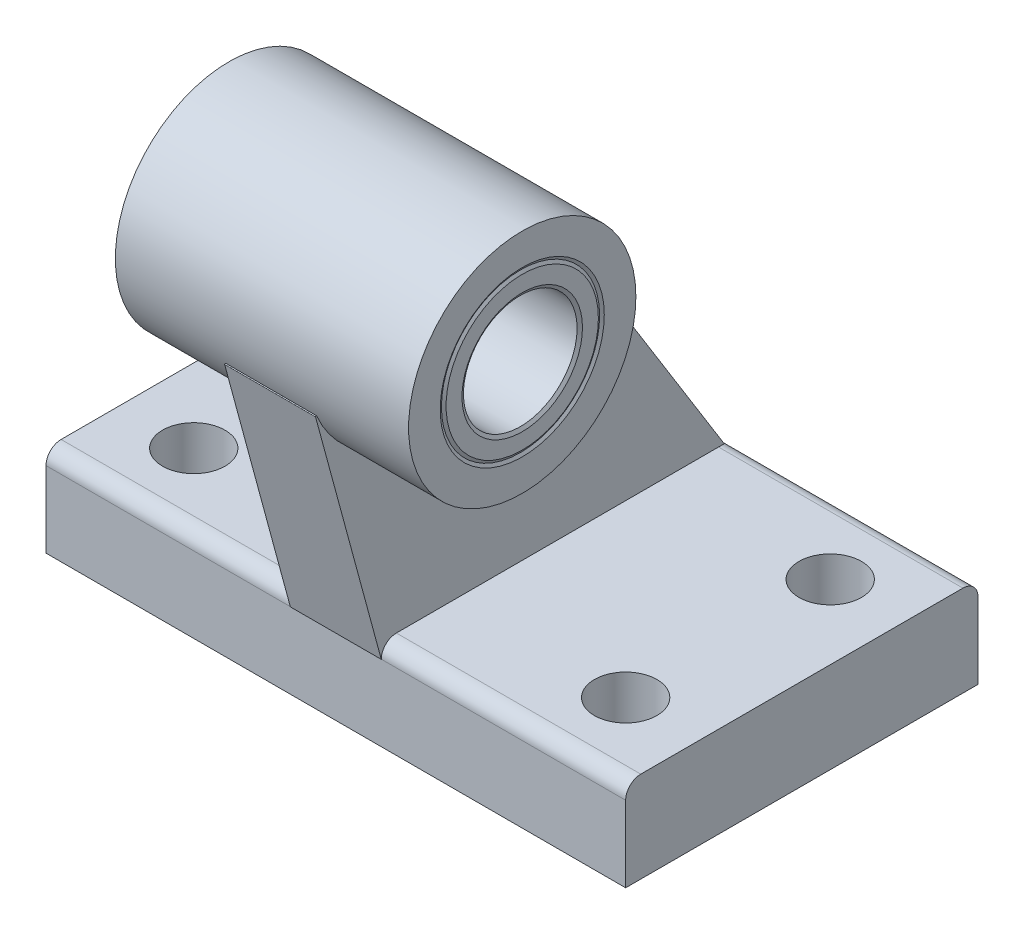
ISO-10303-21;
HEADER;
FILE_DESCRIPTION(('STEP AP214'),'2;1');
FILE_NAME('part.step','',(''),(''),'','','');
FILE_SCHEMA(('AUTOMOTIVE_DESIGN { 1 0 10303 214 1 1 1 1 }'));
ENDSEC;
DATA;
#1=APPLICATION_CONTEXT('core data for automotive mechanical design processes');
#2=APPLICATION_PROTOCOL_DEFINITION('international standard','automotive_design',2000,#1);
#3=PRODUCT_CONTEXT('',#1,'mechanical');
#4=PRODUCT('Part','Part','',(#3));
#5=PRODUCT_RELATED_PRODUCT_CATEGORY('part','',(#4));
#6=PRODUCT_DEFINITION_FORMATION('','',#4);
#7=PRODUCT_DEFINITION_CONTEXT('part definition',#1,'design');
#8=PRODUCT_DEFINITION('design','',#6,#7);
#9=PRODUCT_DEFINITION_SHAPE('','',#8);
#10=(LENGTH_UNIT() NAMED_UNIT(*) SI_UNIT(.MILLI.,.METRE.));
#11=(NAMED_UNIT(*) PLANE_ANGLE_UNIT() SI_UNIT($,.RADIAN.));
#12=(NAMED_UNIT(*) SI_UNIT($,.STERADIAN.) SOLID_ANGLE_UNIT());
#13=UNCERTAINTY_MEASURE_WITH_UNIT(LENGTH_MEASURE(1.E-05),#10,'distance_accuracy_value','');
#14=(GEOMETRIC_REPRESENTATION_CONTEXT(3) GLOBAL_UNCERTAINTY_ASSIGNED_CONTEXT((#13)) GLOBAL_UNIT_ASSIGNED_CONTEXT((#10,
#11,#12)) REPRESENTATION_CONTEXT('',''));
#15=CARTESIAN_POINT('',(0.,0.,0.));
#16=DIRECTION('',(0.,0.,1.));
#17=DIRECTION('',(1.,0.,0.));
#18=AXIS2_PLACEMENT_3D('',#15,#16,#17);
#19=CARTESIAN_POINT('',(25.5,6.67199999999995,14.1719999999999));
#20=DIRECTION('',(-1.,0.,0.));
#21=DIRECTION('',(0.,0.,1.));
#22=AXIS2_PLACEMENT_3D('',#19,#20,#21);
#23=CYLINDRICAL_SURFACE('',#22,1.32800000000005);
#24=CARTESIAN_POINT('',(4.,6.67199999999995,14.1719999999999));
#25=DIRECTION('',(-1.,0.,0.));
#26=DIRECTION('',(0.,0.,1.));
#27=AXIS2_PLACEMENT_3D('',#24,#25,#26);
#28=CIRCLE('',#27,1.32800000000005);
#29=CARTESIAN_POINT('',(4.,6.67199999999995,15.5));
#30=VERTEX_POINT('',#29);
#31=CARTESIAN_POINT('',(4.,8.,14.172));
#32=VERTEX_POINT('',#31);
#33=EDGE_CURVE('E192',#30,#32,#28,.T.);
#34=ORIENTED_EDGE('',*,*,#33,.F.);
#35=DIRECTION('',(-1.,0.,0.));
#36=VECTOR('',#35,1.);
#37=CARTESIAN_POINT('',(25.5,6.672,15.5));
#38=LINE('',#37,#36);
#39=CARTESIAN_POINT('',(25.5,6.672,15.5));
#40=VERTEX_POINT('',#39);
#41=EDGE_CURVE('E241',#40,#30,#38,.T.);
#42=ORIENTED_EDGE('',*,*,#41,.F.);
#43=CARTESIAN_POINT('',(25.5,6.67199999999995,14.1719999999999));
#44=DIRECTION('',(1.,0.,0.));
#45=DIRECTION('',(0.,0.,-1.));
#46=AXIS2_PLACEMENT_3D('',#43,#44,#45);
#47=CIRCLE('',#46,1.32800000000005);
#48=CARTESIAN_POINT('',(25.5,8.,14.172));
#49=VERTEX_POINT('',#48);
#50=EDGE_CURVE('E214',#49,#40,#47,.T.);
#51=ORIENTED_EDGE('',*,*,#50,.F.);
#52=DIRECTION('',(-1.,0.,0.));
#53=VECTOR('',#52,1.);
#54=CARTESIAN_POINT('',(25.5,8.,14.172));
#55=LINE('',#54,#53);
#56=EDGE_CURVE('E226',#49,#32,#55,.T.);
#57=ORIENTED_EDGE('',*,*,#56,.T.);
#58=EDGE_LOOP('',(#34,#42,#51,#57));
#59=FACE_BOUND('',#58,.T.);
#60=ADVANCED_FACE('F32',(#59),#23,.T.);
#61=CARTESIAN_POINT('',(25.5,6.672,15.5));
#62=DIRECTION('',(0.,0.,-1.));
#63=DIRECTION('',(-1.,0.,0.));
#64=AXIS2_PLACEMENT_3D('',#61,#62,#63);
#65=PLANE('',#64);
#66=DIRECTION('',(0.,1.,0.));
#67=VECTOR('',#66,1.);
#68=CARTESIAN_POINT('',(4.,6.672,15.5));
#69=LINE('',#68,#67);
#70=CARTESIAN_POINT('',(4.,6.656,15.5));
#71=VERTEX_POINT('',#70);
#72=EDGE_CURVE('E194',#71,#30,#69,.T.);
#73=ORIENTED_EDGE('',*,*,#72,.F.);
#74=DIRECTION('',(-1.,0.,0.));
#75=VECTOR('',#74,1.);
#76=CARTESIAN_POINT('',(4.,6.656,15.5));
#77=LINE('',#76,#75);
#78=CARTESIAN_POINT('',(-4.,6.656,15.5));
#79=VERTEX_POINT('',#78);
#80=EDGE_CURVE('E179',#71,#79,#77,.T.);
#81=ORIENTED_EDGE('',*,*,#80,.T.);
#82=DIRECTION('',(0.,1.,0.));
#83=VECTOR('',#82,1.);
#84=CARTESIAN_POINT('',(-4.,6.672,15.5));
#85=LINE('',#84,#83);
#86=CARTESIAN_POINT('',(-4.,6.67199999999995,15.5));
#87=VERTEX_POINT('',#86);
#88=EDGE_CURVE('E189',#79,#87,#85,.T.);
#89=ORIENTED_EDGE('',*,*,#88,.T.);
#90=CARTESIAN_POINT('',(-25.5,6.672,15.5));
#91=VERTEX_POINT('',#90);
#92=EDGE_CURVE('E240',#87,#91,#38,.T.);
#93=ORIENTED_EDGE('',*,*,#92,.T.);
#94=DIRECTION('',(0.,-1.,0.));
#95=VECTOR('',#94,1.);
#96=CARTESIAN_POINT('',(-25.5,6.672,15.5));
#97=LINE('',#96,#95);
#98=CARTESIAN_POINT('',(-25.5,0.,15.5));
#99=VERTEX_POINT('',#98);
#100=EDGE_CURVE('E199',#91,#99,#97,.T.);
#101=ORIENTED_EDGE('',*,*,#100,.T.);
#102=DIRECTION('',(-1.,0.,0.));
#103=VECTOR('',#102,1.);
#104=CARTESIAN_POINT('',(25.5,0.,15.5));
#105=LINE('',#104,#103);
#106=CARTESIAN_POINT('',(25.5,0.,15.5));
#107=VERTEX_POINT('',#106);
#108=EDGE_CURVE('E238',#107,#99,#105,.T.);
#109=ORIENTED_EDGE('',*,*,#108,.F.);
#110=DIRECTION('',(0.,-1.,0.));
#111=VECTOR('',#110,1.);
#112=CARTESIAN_POINT('',(25.5,6.672,15.5));
#113=LINE('',#112,#111);
#114=EDGE_CURVE('E216',#40,#107,#113,.T.);
#115=ORIENTED_EDGE('',*,*,#114,.F.);
#116=ORIENTED_EDGE('',*,*,#41,.T.);
#117=EDGE_LOOP('',(#73,#81,#89,#93,#101,#109,#115,#116));
#118=FACE_BOUND('',#117,.T.);
#119=ADVANCED_FACE('F336',(#118),#65,.F.);
#120=CARTESIAN_POINT('',(25.5,8.,-14.172));
#121=DIRECTION('',(0.,-1.,0.));
#122=DIRECTION('',(0.,0.,-1.));
#123=AXIS2_PLACEMENT_3D('',#120,#121,#122);
#124=PLANE('',#123);
#125=CARTESIAN_POINT('',(19.,8.,-9.));
#126=DIRECTION('',(0.,1.,0.));
#127=DIRECTION('',(0.,0.,1.));
#128=AXIS2_PLACEMENT_3D('',#125,#126,#127);
#129=CIRCLE('',#128,2.75);
#130=CARTESIAN_POINT('',(19.,8.,-6.25));
#131=VERTEX_POINT('',#130);
#132=EDGE_CURVE('E266',#131,#131,#129,.T.);
#133=ORIENTED_EDGE('',*,*,#132,.F.);
#134=EDGE_LOOP('',(#133));
#135=FACE_BOUND('',#134,.T.);
#136=CARTESIAN_POINT('',(19.,8.,9.));
#137=DIRECTION('',(0.,1.,0.));
#138=DIRECTION('',(0.,0.,1.));
#139=AXIS2_PLACEMENT_3D('',#136,#137,#138);
#140=CIRCLE('',#139,2.75);
#141=CARTESIAN_POINT('',(19.,8.,11.75));
#142=VERTEX_POINT('',#141);
#143=EDGE_CURVE('E278',#142,#142,#140,.T.);
#144=ORIENTED_EDGE('',*,*,#143,.F.);
#145=EDGE_LOOP('',(#144));
#146=FACE_BOUND('',#145,.T.);
#147=DIRECTION('',(0.,0.,-1.));
#148=VECTOR('',#147,1.);
#149=CARTESIAN_POINT('',(4.,8.,-14.172));
#150=LINE('',#149,#148);
#151=CARTESIAN_POINT('',(4.,8.,-14.172));
#152=VERTEX_POINT('',#151);
#153=EDGE_CURVE('E11',#32,#152,#150,.T.);
#154=ORIENTED_EDGE('',*,*,#153,.F.);
#155=ORIENTED_EDGE('',*,*,#56,.F.);
#156=DIRECTION('',(0.,0.,1.));
#157=VECTOR('',#156,1.);
#158=CARTESIAN_POINT('',(25.5,8.,-14.172));
#159=LINE('',#158,#157);
#160=CARTESIAN_POINT('',(25.5,8.,-14.172));
#161=VERTEX_POINT('',#160);
#162=EDGE_CURVE('E56',#161,#49,#159,.T.);
#163=ORIENTED_EDGE('',*,*,#162,.F.);
#164=DIRECTION('',(-1.,0.,0.));
#165=VECTOR('',#164,1.);
#166=CARTESIAN_POINT('',(25.5,8.,-14.172));
#167=LINE('',#166,#165);
#168=EDGE_CURVE('E230',#161,#152,#167,.T.);
#169=ORIENTED_EDGE('',*,*,#168,.T.);
#170=EDGE_LOOP('',(#154,#155,#163,#169));
#171=FACE_BOUND('',#170,.T.);
#172=ADVANCED_FACE('F361',(#135,#146,#171),#124,.F.);
#173=ORIENTED_EDGE('',*,*,#92,.F.);
#174=CARTESIAN_POINT('',(-4.,6.67199999999995,14.1719999999999));
#175=DIRECTION('',(-1.,0.,0.));
#176=DIRECTION('',(0.,0.,1.));
#177=AXIS2_PLACEMENT_3D('',#174,#175,#176);
#178=CIRCLE('',#177,1.32800000000005);
#179=CARTESIAN_POINT('',(-4.,8.,14.172));
#180=VERTEX_POINT('',#179);
#181=EDGE_CURVE('E186',#87,#180,#178,.T.);
#182=ORIENTED_EDGE('',*,*,#181,.T.);
#183=CARTESIAN_POINT('',(-25.5,8.,14.172));
#184=VERTEX_POINT('',#183);
#185=EDGE_CURVE('E225',#180,#184,#55,.T.);
#186=ORIENTED_EDGE('',*,*,#185,.T.);
#187=CARTESIAN_POINT('',(-25.5,6.67199999999995,14.1719999999999));
#188=DIRECTION('',(1.,0.,0.));
#189=DIRECTION('',(0.,0.,-1.));
#190=AXIS2_PLACEMENT_3D('',#187,#188,#189);
#191=CIRCLE('',#190,1.32800000000005);
#192=EDGE_CURVE('E196',#184,#91,#191,.T.);
#193=ORIENTED_EDGE('',*,*,#192,.T.);
#194=EDGE_LOOP('',(#173,#182,#186,#193));
#195=FACE_BOUND('',#194,.T.);
#196=ADVANCED_FACE('F34',(#195),#23,.T.);
#197=CARTESIAN_POINT('',(25.5,0.,15.5));
#198=DIRECTION('',(0.,1.,0.));
#199=DIRECTION('',(0.,0.,1.));
#200=AXIS2_PLACEMENT_3D('',#197,#198,#199);
#201=PLANE('',#200);
#202=CARTESIAN_POINT('',(19.,0.,-9.));
#203=DIRECTION('',(0.,1.,0.));
#204=DIRECTION('',(0.,0.,1.));
#205=AXIS2_PLACEMENT_3D('',#202,#203,#204);
#206=CIRCLE('',#205,2.75);
#207=CARTESIAN_POINT('',(19.,0.,-6.25));
#208=VERTEX_POINT('',#207);
#209=EDGE_CURVE('E269',#208,#208,#206,.T.);
#210=ORIENTED_EDGE('',*,*,#209,.T.);
#211=EDGE_LOOP('',(#210));
#212=FACE_BOUND('',#211,.T.);
#213=CARTESIAN_POINT('',(-19.,0.,-9.));
#214=DIRECTION('',(0.,1.,0.));
#215=DIRECTION('',(0.,0.,1.));
#216=AXIS2_PLACEMENT_3D('',#213,#214,#215);
#217=CIRCLE('',#216,2.75);
#218=CARTESIAN_POINT('',(-19.,0.,-6.25));
#219=VERTEX_POINT('',#218);
#220=EDGE_CURVE('E275',#219,#219,#217,.T.);
#221=ORIENTED_EDGE('',*,*,#220,.T.);
#222=EDGE_LOOP('',(#221));
#223=FACE_BOUND('',#222,.T.);
#224=CARTESIAN_POINT('',(19.,0.,9.));
#225=DIRECTION('',(0.,1.,0.));
#226=DIRECTION('',(0.,0.,1.));
#227=AXIS2_PLACEMENT_3D('',#224,#225,#226);
#228=CIRCLE('',#227,2.75);
#229=CARTESIAN_POINT('',(19.,0.,11.75));
#230=VERTEX_POINT('',#229);
#231=EDGE_CURVE('E281',#230,#230,#228,.T.);
#232=ORIENTED_EDGE('',*,*,#231,.T.);
#233=EDGE_LOOP('',(#232));
#234=FACE_BOUND('',#233,.T.);
#235=CARTESIAN_POINT('',(-19.,0.,9.));
#236=DIRECTION('',(0.,1.,0.));
#237=DIRECTION('',(0.,0.,1.));
#238=AXIS2_PLACEMENT_3D('',#235,#236,#237);
#239=CIRCLE('',#238,2.75);
#240=CARTESIAN_POINT('',(-19.,0.,11.75));
#241=VERTEX_POINT('',#240);
#242=EDGE_CURVE('E287',#241,#241,#239,.T.);
#243=ORIENTED_EDGE('',*,*,#242,.T.);
#244=EDGE_LOOP('',(#243));
#245=FACE_BOUND('',#244,.T.);
#246=ORIENTED_EDGE('',*,*,#108,.T.);
#247=DIRECTION('',(0.,0.,-1.));
#248=VECTOR('',#247,1.);
#249=CARTESIAN_POINT('',(-25.5,0.,15.5));
#250=LINE('',#249,#248);
#251=CARTESIAN_POINT('',(-25.5,0.,-15.5));
#252=VERTEX_POINT('',#251);
#253=EDGE_CURVE('E202',#99,#252,#250,.T.);
#254=ORIENTED_EDGE('',*,*,#253,.T.);
#255=DIRECTION('',(-1.,0.,0.));
#256=VECTOR('',#255,1.);
#257=CARTESIAN_POINT('',(25.5,0.,-15.5));
#258=LINE('',#257,#256);
#259=CARTESIAN_POINT('',(25.5,0.,-15.5));
#260=VERTEX_POINT('',#259);
#261=EDGE_CURVE('E236',#260,#252,#258,.T.);
#262=ORIENTED_EDGE('',*,*,#261,.F.);
#263=DIRECTION('',(0.,0.,-1.));
#264=VECTOR('',#263,1.);
#265=CARTESIAN_POINT('',(25.5,0.,15.5));
#266=LINE('',#265,#264);
#267=EDGE_CURVE('E218',#107,#260,#266,.T.);
#268=ORIENTED_EDGE('',*,*,#267,.F.);
#269=EDGE_LOOP('',(#246,#254,#262,#268));
#270=FACE_BOUND('',#269,.T.);
#271=ADVANCED_FACE('F367',(#212,#223,#234,#245,#270),#201,.F.);
#272=CARTESIAN_POINT('',(25.5,0.,-15.5));
#273=DIRECTION('',(0.,0.,1.));
#274=DIRECTION('',(1.,0.,0.));
#275=AXIS2_PLACEMENT_3D('',#272,#273,#274);
#276=PLANE('',#275);
#277=ORIENTED_EDGE('',*,*,#261,.T.);
#278=DIRECTION('',(0.,1.,0.));
#279=VECTOR('',#278,1.);
#280=CARTESIAN_POINT('',(-25.5,0.,-15.5));
#281=LINE('',#280,#279);
#282=CARTESIAN_POINT('',(-25.5,6.672,-15.5));
#283=VERTEX_POINT('',#282);
#284=EDGE_CURVE('E205',#252,#283,#281,.T.);
#285=ORIENTED_EDGE('',*,*,#284,.T.);
#286=DIRECTION('',(-1.,0.,0.));
#287=VECTOR('',#286,1.);
#288=CARTESIAN_POINT('',(25.5,6.672,-15.5));
#289=LINE('',#288,#287);
#290=CARTESIAN_POINT('',(25.5,6.672,-15.5));
#291=VERTEX_POINT('',#290);
#292=EDGE_CURVE('E233',#291,#283,#289,.T.);
#293=ORIENTED_EDGE('',*,*,#292,.F.);
#294=DIRECTION('',(0.,1.,0.));
#295=VECTOR('',#294,1.);
#296=CARTESIAN_POINT('',(25.5,0.,-15.5));
#297=LINE('',#296,#295);
#298=EDGE_CURVE('E220',#260,#291,#297,.T.);
#299=ORIENTED_EDGE('',*,*,#298,.F.);
#300=EDGE_LOOP('',(#277,#285,#293,#299));
#301=FACE_BOUND('',#300,.T.);
#302=ADVANCED_FACE('F372',(#301),#276,.F.);
#303=CARTESIAN_POINT('',(25.5,6.67199999999995,-14.1719999999999));
#304=DIRECTION('',(-1.,0.,0.));
#305=DIRECTION('',(0.,0.,1.));
#306=AXIS2_PLACEMENT_3D('',#303,#304,#305);
#307=CYLINDRICAL_SURFACE('',#306,1.32800000000005);
#308=ORIENTED_EDGE('',*,*,#292,.T.);
#309=CARTESIAN_POINT('',(-25.5,6.67199999999995,-14.1719999999999));
#310=DIRECTION('',(1.,0.,0.));
#311=DIRECTION('',(0.,0.,-1.));
#312=AXIS2_PLACEMENT_3D('',#309,#310,#311);
#313=CIRCLE('',#312,1.32800000000005);
#314=CARTESIAN_POINT('',(-25.5,8.,-14.172));
#315=VERTEX_POINT('',#314);
#316=EDGE_CURVE('E208',#283,#315,#313,.T.);
#317=ORIENTED_EDGE('',*,*,#316,.T.);
#318=CARTESIAN_POINT('',(-4.,8.,-14.172));
#319=VERTEX_POINT('',#318);
#320=EDGE_CURVE('E229',#319,#315,#167,.T.);
#321=ORIENTED_EDGE('',*,*,#320,.F.);
#322=EDGE_CURVE('E234',#152,#319,#167,.T.);
#323=ORIENTED_EDGE('',*,*,#322,.F.);
#324=ORIENTED_EDGE('',*,*,#168,.F.);
#325=CARTESIAN_POINT('',(25.5,6.67199999999995,-14.1719999999999));
#326=DIRECTION('',(1.,0.,0.));
#327=DIRECTION('',(0.,0.,-1.));
#328=AXIS2_PLACEMENT_3D('',#325,#326,#327);
#329=CIRCLE('',#328,1.32800000000005);
#330=EDGE_CURVE('E222',#291,#161,#329,.T.);
#331=ORIENTED_EDGE('',*,*,#330,.F.);
#332=EDGE_LOOP('',(#308,#317,#321,#323,#324,#331));
#333=FACE_BOUND('',#332,.T.);
#334=ADVANCED_FACE('F322',(#333),#307,.T.);
#335=CARTESIAN_POINT('',(-19.,8.,-9.));
#336=DIRECTION('',(0.,1.,0.));
#337=DIRECTION('',(0.,0.,1.));
#338=AXIS2_PLACEMENT_3D('',#335,#336,#337);
#339=CIRCLE('',#338,2.75);
#340=CARTESIAN_POINT('',(-19.,8.,-6.25));
#341=VERTEX_POINT('',#340);
#342=EDGE_CURVE('E272',#341,#341,#339,.T.);
#343=ORIENTED_EDGE('',*,*,#342,.F.);
#344=EDGE_LOOP('',(#343));
#345=FACE_BOUND('',#344,.T.);
#346=CARTESIAN_POINT('',(-19.,8.,9.));
#347=DIRECTION('',(0.,1.,0.));
#348=DIRECTION('',(0.,0.,1.));
#349=AXIS2_PLACEMENT_3D('',#346,#347,#348);
#350=CIRCLE('',#349,2.75);
#351=CARTESIAN_POINT('',(-19.,8.,11.75));
#352=VERTEX_POINT('',#351);
#353=EDGE_CURVE('E284',#352,#352,#350,.T.);
#354=ORIENTED_EDGE('',*,*,#353,.F.);
#355=EDGE_LOOP('',(#354));
#356=FACE_BOUND('',#355,.T.);
#357=ORIENTED_EDGE('',*,*,#185,.F.);
#358=DIRECTION('',(0.,0.,-1.));
#359=VECTOR('',#358,1.);
#360=CARTESIAN_POINT('',(-4.,8.,-14.172));
#361=LINE('',#360,#359);
#362=EDGE_CURVE('E41',#180,#319,#361,.T.);
#363=ORIENTED_EDGE('',*,*,#362,.T.);
#364=ORIENTED_EDGE('',*,*,#320,.T.);
#365=DIRECTION('',(0.,0.,1.));
#366=VECTOR('',#365,1.);
#367=CARTESIAN_POINT('',(-25.5,8.,-14.172));
#368=LINE('',#367,#366);
#369=EDGE_CURVE('E211',#315,#184,#368,.T.);
#370=ORIENTED_EDGE('',*,*,#369,.T.);
#371=EDGE_LOOP('',(#357,#363,#364,#370));
#372=FACE_BOUND('',#371,.T.);
#373=ADVANCED_FACE('F325',(#345,#356,#372),#124,.F.);
#374=CARTESIAN_POINT('',(25.5,6.67199999999995,14.1719999999999));
#375=DIRECTION('',(1.,0.,0.));
#376=DIRECTION('',(0.,0.,-1.));
#377=AXIS2_PLACEMENT_3D('',#374,#375,#376);
#378=PLANE('',#377);
#379=ORIENTED_EDGE('',*,*,#50,.T.);
#380=ORIENTED_EDGE('',*,*,#114,.T.);
#381=ORIENTED_EDGE('',*,*,#267,.T.);
#382=ORIENTED_EDGE('',*,*,#298,.T.);
#383=ORIENTED_EDGE('',*,*,#330,.T.);
#384=ORIENTED_EDGE('',*,*,#162,.T.);
#385=EDGE_LOOP('',(#379,#380,#381,#382,#383,#384));
#386=FACE_BOUND('',#385,.T.);
#387=ADVANCED_FACE('F351',(#386),#378,.T.);
#388=CARTESIAN_POINT('',(-25.5,6.67199999999995,14.1719999999999));
#389=DIRECTION('',(1.,0.,0.));
#390=DIRECTION('',(0.,0.,-1.));
#391=AXIS2_PLACEMENT_3D('',#388,#389,#390);
#392=PLANE('',#391);
#393=ORIENTED_EDGE('',*,*,#192,.F.);
#394=ORIENTED_EDGE('',*,*,#369,.F.);
#395=ORIENTED_EDGE('',*,*,#316,.F.);
#396=ORIENTED_EDGE('',*,*,#284,.F.);
#397=ORIENTED_EDGE('',*,*,#253,.F.);
#398=ORIENTED_EDGE('',*,*,#100,.F.);
#399=EDGE_LOOP('',(#393,#394,#395,#396,#397,#398));
#400=FACE_BOUND('',#399,.T.);
#401=ADVANCED_FACE('F328',(#400),#392,.F.);
#402=CARTESIAN_POINT('',(4.,8.,14.156));
#403=DIRECTION('',(0.,1.,0.));
#404=DIRECTION('',(0.,0.,1.));
#405=AXIS2_PLACEMENT_3D('',#402,#403,#404);
#406=PLANE('',#405);
#407=DIRECTION('',(0.,0.,-1.));
#408=VECTOR('',#407,1.);
#409=CARTESIAN_POINT('',(4.,8.,14.156));
#410=LINE('',#409,#408);
#411=CARTESIAN_POINT('',(4.,8.,-14.6753125783923));
#412=VERTEX_POINT('',#411);
#413=EDGE_CURVE('E307',#152,#412,#410,.T.);
#414=ORIENTED_EDGE('',*,*,#413,.F.);
#415=ORIENTED_EDGE('',*,*,#322,.T.);
#416=DIRECTION('',(0.,0.,-1.));
#417=VECTOR('',#416,1.);
#418=CARTESIAN_POINT('',(-4.,8.,14.156));
#419=LINE('',#418,#417);
#420=CARTESIAN_POINT('',(-4.,8.,-14.6753125783923));
#421=VERTEX_POINT('',#420);
#422=EDGE_CURVE('E299',#319,#421,#419,.T.);
#423=ORIENTED_EDGE('',*,*,#422,.T.);
#424=DIRECTION('',(-1.,0.,0.));
#425=VECTOR('',#424,1.);
#426=CARTESIAN_POINT('',(4.,8.,-14.6753125783923));
#427=LINE('',#426,#425);
#428=EDGE_CURVE('E171',#412,#421,#427,.T.);
#429=ORIENTED_EDGE('',*,*,#428,.F.);
#430=EDGE_LOOP('',(#414,#415,#423,#429));
#431=FACE_BOUND('',#430,.T.);
#432=ADVANCED_FACE('F319',(#431),#406,.F.);
#433=CARTESIAN_POINT('',(4.,31.9999999999993,11.9999999999997));
#434=DIRECTION('',(-1.,0.,0.));
#435=DIRECTION('',(0.,0.,1.));
#436=AXIS2_PLACEMENT_3D('',#433,#434,#435);
#437=PLANE('',#436);
#438=DIRECTION('',(0.,-0.965266392657303,-0.261267661998873));
#439=VECTOR('',#438,1.);
#440=CARTESIAN_POINT('',(4.,28.0222305562123,21.2831756555647));
#441=LINE('',#440,#439);
#442=CARTESIAN_POINT('',(4.,28.0222305562123,21.2831756555647));
#443=VERTEX_POINT('',#442);
#444=EDGE_CURVE('E305',#443,#71,#441,.T.);
#445=ORIENTED_EDGE('',*,*,#444,.T.);
#446=ORIENTED_EDGE('',*,*,#72,.T.);
#447=ORIENTED_EDGE('',*,*,#33,.T.);
#448=ORIENTED_EDGE('',*,*,#153,.T.);
#449=ORIENTED_EDGE('',*,*,#413,.T.);
#450=DIRECTION('',(0.,0.849522179744733,0.527552903623663));
#451=VECTOR('',#450,1.);
#452=CARTESIAN_POINT('',(4.,8.,-14.6753125783923));
#453=LINE('',#452,#451);
#454=CARTESIAN_POINT('',(4.,36.0741232481049,2.75870573137879));
#455=VERTEX_POINT('',#454);
#456=EDGE_CURVE('E173',#412,#455,#453,.T.);
#457=ORIENTED_EDGE('',*,*,#456,.T.);
#458=CARTESIAN_POINT('',(4.,36.0477456029237,2.80118184036602));
#459=DIRECTION('',(1.,0.,0.));
#460=DIRECTION('',(0.,0.,-1.));
#461=AXIS2_PLACEMENT_3D('',#458,#459,#460);
#462=CIRCLE('',#461,0.0500000000000079);
#463=CARTESIAN_POINT('',(4.,36.0276075650982,2.84694710484182));
#464=VERTEX_POINT('',#463);
#465=EDGE_CURVE('E169',#455,#464,#462,.T.);
#466=ORIENTED_EDGE('',*,*,#465,.T.);
#467=CARTESIAN_POINT('',(4.,31.9999999999993,11.9999999999997));
#468=DIRECTION('',(-1.,0.,0.));
#469=DIRECTION('',(0.,0.,1.));
#470=AXIS2_PLACEMENT_3D('',#467,#468,#469);
#471=CIRCLE('',#470,9.99999999999999);
#472=CARTESIAN_POINT('',(4.,28.0550188450868,21.1889674984396));
#473=VERTEX_POINT('',#472);
#474=EDGE_CURVE('E152',#464,#473,#471,.T.);
#475=ORIENTED_EDGE('',*,*,#474,.T.);
#476=CARTESIAN_POINT('',(4.,28.0352939393124,21.2349123359319));
#477=DIRECTION('',(1.,0.,0.));
#478=DIRECTION('',(0.,0.,-1.));
#479=AXIS2_PLACEMENT_3D('',#476,#477,#478);
#480=CIRCLE('',#479,0.0500000000000067);
#481=EDGE_CURVE('E303',#473,#443,#480,.T.);
#482=ORIENTED_EDGE('',*,*,#481,.T.);
#483=EDGE_LOOP('',(#445,#446,#447,#448,#449,#457,#466,#475,#482));
#484=FACE_BOUND('',#483,.T.);
#485=ADVANCED_FACE('F310',(#484),#437,.F.);
#486=CARTESIAN_POINT('',(-4.,31.9999999999993,11.9999999999997));
#487=DIRECTION('',(-1.,0.,0.));
#488=DIRECTION('',(0.,0.,1.));
#489=AXIS2_PLACEMENT_3D('',#486,#487,#488);
#490=PLANE('',#489);
#491=ORIENTED_EDGE('',*,*,#88,.F.);
#492=DIRECTION('',(0.,-0.965266392657303,-0.261267661998873));
#493=VECTOR('',#492,1.);
#494=CARTESIAN_POINT('',(-4.,28.0222305562123,21.2831756555647));
#495=LINE('',#494,#493);
#496=CARTESIAN_POINT('',(-4.,28.0222305562123,21.2831756555647));
#497=VERTEX_POINT('',#496);
#498=EDGE_CURVE('E296',#497,#79,#495,.T.);
#499=ORIENTED_EDGE('',*,*,#498,.F.);
#500=CARTESIAN_POINT('',(-4.,28.0352939393124,21.2349123359319));
#501=DIRECTION('',(1.,0.,0.));
#502=DIRECTION('',(0.,0.,-1.));
#503=AXIS2_PLACEMENT_3D('',#500,#501,#502);
#504=CIRCLE('',#503,0.0500000000000067);
#505=CARTESIAN_POINT('',(-4.,28.0550188450868,21.1889674984396));
#506=VERTEX_POINT('',#505);
#507=EDGE_CURVE('E161',#506,#497,#504,.T.);
#508=ORIENTED_EDGE('',*,*,#507,.F.);
#509=CARTESIAN_POINT('',(-4.,31.9999999999993,11.9999999999997));
#510=DIRECTION('',(-1.,0.,0.));
#511=DIRECTION('',(0.,0.,1.));
#512=AXIS2_PLACEMENT_3D('',#509,#510,#511);
#513=CIRCLE('',#512,9.99999999999999);
#514=CARTESIAN_POINT('',(-4.,36.0276075650982,2.8469471048418));
#515=VERTEX_POINT('',#514);
#516=EDGE_CURVE('E157',#515,#506,#513,.T.);
#517=ORIENTED_EDGE('',*,*,#516,.F.);
#518=CARTESIAN_POINT('',(-4.,36.0477456029237,2.80118184036602));
#519=DIRECTION('',(1.,0.,0.));
#520=DIRECTION('',(0.,0.,-1.));
#521=AXIS2_PLACEMENT_3D('',#518,#519,#520);
#522=CIRCLE('',#521,0.0500000000000079);
#523=CARTESIAN_POINT('',(-4.,36.0741232481049,2.75870573137879));
#524=VERTEX_POINT('',#523);
#525=EDGE_CURVE('E140',#524,#515,#522,.T.);
#526=ORIENTED_EDGE('',*,*,#525,.F.);
#527=DIRECTION('',(0.,0.849522179744733,0.527552903623663));
#528=VECTOR('',#527,1.);
#529=CARTESIAN_POINT('',(-4.,8.,-14.6753125783923));
#530=LINE('',#529,#528);
#531=EDGE_CURVE('E153',#421,#524,#530,.T.);
#532=ORIENTED_EDGE('',*,*,#531,.F.);
#533=ORIENTED_EDGE('',*,*,#422,.F.);
#534=ORIENTED_EDGE('',*,*,#362,.F.);
#535=ORIENTED_EDGE('',*,*,#181,.F.);
#536=EDGE_LOOP('',(#491,#499,#508,#517,#526,#532,#533,#534,#535));
#537=FACE_BOUND('',#536,.T.);
#538=ADVANCED_FACE('F158',(#537),#490,.T.);
#539=CARTESIAN_POINT('',(4.,28.0352939393124,21.2349123359319));
#540=DIRECTION('',(-1.,0.,0.));
#541=DIRECTION('',(0.,0.,1.));
#542=AXIS2_PLACEMENT_3D('',#539,#540,#541);
#543=CYLINDRICAL_SURFACE('',#542,0.0500000000000067);
#544=DIRECTION('',(-1.,0.,0.));
#545=VECTOR('',#544,1.);
#546=CARTESIAN_POINT('',(4.,28.0550188450868,21.1889674984396));
#547=LINE('',#546,#545);
#548=EDGE_CURVE('E184',#473,#506,#547,.T.);
#549=ORIENTED_EDGE('',*,*,#548,.T.);
#550=ORIENTED_EDGE('',*,*,#507,.T.);
#551=DIRECTION('',(-1.,0.,0.));
#552=VECTOR('',#551,1.);
#553=CARTESIAN_POINT('',(4.,28.0222305562123,21.2831756555647));
#554=LINE('',#553,#552);
#555=EDGE_CURVE('E182',#443,#497,#554,.T.);
#556=ORIENTED_EDGE('',*,*,#555,.F.);
#557=ORIENTED_EDGE('',*,*,#481,.F.);
#558=EDGE_LOOP('',(#549,#550,#556,#557));
#559=FACE_BOUND('',#558,.T.);
#560=ADVANCED_FACE('F343',(#559),#543,.T.);
#561=CARTESIAN_POINT('',(4.,28.0222305562123,21.2831756555647));
#562=DIRECTION('',(0.,0.261267661998873,-0.965266392657303));
#563=DIRECTION('',(0.,0.965266392657303,0.261267661998873));
#564=AXIS2_PLACEMENT_3D('',#561,#562,#563);
#565=PLANE('',#564);
#566=ORIENTED_EDGE('',*,*,#555,.T.);
#567=ORIENTED_EDGE('',*,*,#498,.T.);
#568=ORIENTED_EDGE('',*,*,#80,.F.);
#569=ORIENTED_EDGE('',*,*,#444,.F.);
#570=EDGE_LOOP('',(#566,#567,#568,#569));
#571=FACE_BOUND('',#570,.T.);
#572=ADVANCED_FACE('F340',(#571),#565,.F.);
#573=CARTESIAN_POINT('',(4.,8.,-14.6753125783923));
#574=DIRECTION('',(0.,-0.527552903623663,0.849522179744733));
#575=DIRECTION('',(0.,-0.849522179744733,-0.527552903623663));
#576=AXIS2_PLACEMENT_3D('',#573,#574,#575);
#577=PLANE('',#576);
#578=ORIENTED_EDGE('',*,*,#428,.T.);
#579=ORIENTED_EDGE('',*,*,#531,.T.);
#580=DIRECTION('',(-1.,0.,0.));
#581=VECTOR('',#580,1.);
#582=CARTESIAN_POINT('',(4.,36.0741232481049,2.75870573137879));
#583=LINE('',#582,#581);
#584=EDGE_CURVE('E148',#455,#524,#583,.T.);
#585=ORIENTED_EDGE('',*,*,#584,.F.);
#586=ORIENTED_EDGE('',*,*,#456,.F.);
#587=EDGE_LOOP('',(#578,#579,#585,#586));
#588=FACE_BOUND('',#587,.T.);
#589=ADVANCED_FACE('F314',(#588),#577,.F.);
#590=CARTESIAN_POINT('',(4.,36.0477456029237,2.80118184036602));
#591=DIRECTION('',(-1.,0.,0.));
#592=DIRECTION('',(0.,0.,1.));
#593=AXIS2_PLACEMENT_3D('',#590,#591,#592);
#594=CYLINDRICAL_SURFACE('',#593,0.0500000000000079);
#595=ORIENTED_EDGE('',*,*,#584,.T.);
#596=ORIENTED_EDGE('',*,*,#525,.T.);
#597=DIRECTION('',(-1.,0.,0.));
#598=VECTOR('',#597,1.);
#599=CARTESIAN_POINT('',(4.,36.0276075650982,2.84694710484182));
#600=LINE('',#599,#598);
#601=EDGE_CURVE('E145',#464,#515,#600,.T.);
#602=ORIENTED_EDGE('',*,*,#601,.F.);
#603=ORIENTED_EDGE('',*,*,#465,.F.);
#604=EDGE_LOOP('',(#595,#596,#602,#603));
#605=FACE_BOUND('',#604,.T.);
#606=ADVANCED_FACE('F142',(#605),#594,.T.);
#607=CARTESIAN_POINT('',(12.9,32.,12.));
#608=DIRECTION('',(-1.,0.,0.));
#609=DIRECTION('',(0.,0.,1.));
#610=AXIS2_PLACEMENT_3D('',#607,#608,#609);
#611=CYLINDRICAL_SURFACE('',#610,10.);
#612=ORIENTED_EDGE('',*,*,#548,.F.);
#613=ORIENTED_EDGE('',*,*,#474,.F.);
#614=ORIENTED_EDGE('',*,*,#601,.T.);
#615=ORIENTED_EDGE('',*,*,#516,.T.);
#616=EDGE_LOOP('',(#612,#613,#614,#615));
#617=FACE_BOUND('',#616,.T.);
#618=CARTESIAN_POINT('',(12.9,32.,12.));
#619=DIRECTION('',(1.,0.,0.));
#620=DIRECTION('',(0.,0.,-1.));
#621=AXIS2_PLACEMENT_3D('',#618,#619,#620);
#622=CIRCLE('',#621,10.);
#623=CARTESIAN_POINT('',(12.9,32.,2.));
#624=VERTEX_POINT('',#623);
#625=EDGE_CURVE('E164',#624,#624,#622,.T.);
#626=ORIENTED_EDGE('',*,*,#625,.F.);
#627=EDGE_LOOP('',(#626));
#628=FACE_BOUND('',#627,.T.);
#629=CARTESIAN_POINT('',(-12.9,32.,12.));
#630=DIRECTION('',(1.,0.,0.));
#631=DIRECTION('',(0.,0.,-1.));
#632=AXIS2_PLACEMENT_3D('',#629,#630,#631);
#633=CIRCLE('',#632,10.);
#634=CARTESIAN_POINT('',(-12.9,32.,2.));
#635=VERTEX_POINT('',#634);
#636=EDGE_CURVE('E290',#635,#635,#633,.T.);
#637=ORIENTED_EDGE('',*,*,#636,.T.);
#638=EDGE_LOOP('',(#637));
#639=FACE_BOUND('',#638,.T.);
#640=ADVANCED_FACE('F166',(#617,#628,#639),#611,.T.);
#641=CARTESIAN_POINT('',(12.9,32.,12.));
#642=DIRECTION('',(1.,0.,0.));
#643=DIRECTION('',(0.,0.,-1.));
#644=AXIS2_PLACEMENT_3D('',#641,#642,#643);
#645=PLANE('',#644);
#646=CARTESIAN_POINT('',(12.9,32.,12.));
#647=DIRECTION('',(1.,0.,0.));
#648=DIRECTION('',(0.,0.,-1.));
#649=AXIS2_PLACEMENT_3D('',#646,#647,#648);
#650=CIRCLE('',#649,7.22);
#651=CARTESIAN_POINT('',(12.9,32.,4.78));
#652=VERTEX_POINT('',#651);
#653=EDGE_CURVE('E250',#652,#652,#650,.T.);
#654=ORIENTED_EDGE('',*,*,#653,.F.);
#655=EDGE_LOOP('',(#654));
#656=FACE_BOUND('',#655,.T.);
#657=ORIENTED_EDGE('',*,*,#625,.T.);
#658=EDGE_LOOP('',(#657));
#659=FACE_BOUND('',#658,.T.);
#660=ADVANCED_FACE('F452',(#656,#659),#645,.T.);
#661=CARTESIAN_POINT('',(-12.9,32.,12.));
#662=DIRECTION('',(1.,0.,0.));
#663=DIRECTION('',(0.,0.,-1.));
#664=AXIS2_PLACEMENT_3D('',#661,#662,#663);
#665=PLANE('',#664);
#666=CARTESIAN_POINT('',(-12.9,32.,12.));
#667=DIRECTION('',(1.,0.,0.));
#668=DIRECTION('',(0.,0.,-1.));
#669=AXIS2_PLACEMENT_3D('',#666,#667,#668);
#670=CIRCLE('',#669,7.22);
#671=CARTESIAN_POINT('',(-12.9,32.,4.78));
#672=VERTEX_POINT('',#671);
#673=EDGE_CURVE('E263',#672,#672,#670,.T.);
#674=ORIENTED_EDGE('',*,*,#673,.T.);
#675=EDGE_LOOP('',(#674));
#676=FACE_BOUND('',#675,.T.);
#677=ORIENTED_EDGE('',*,*,#636,.F.);
#678=EDGE_LOOP('',(#677));
#679=FACE_BOUND('',#678,.T.);
#680=ADVANCED_FACE('F457',(#676,#679),#665,.F.);
#681=CARTESIAN_POINT('',(-19.,8.,9.));
#682=DIRECTION('',(0.,1.,0.));
#683=DIRECTION('',(0.,0.,1.));
#684=AXIS2_PLACEMENT_3D('',#681,#682,#683);
#685=CYLINDRICAL_SURFACE('',#684,2.75);
#686=ORIENTED_EDGE('',*,*,#242,.F.);
#687=EDGE_LOOP('',(#686));
#688=FACE_BOUND('',#687,.T.);
#689=ORIENTED_EDGE('',*,*,#353,.T.);
#690=EDGE_LOOP('',(#689));
#691=FACE_BOUND('',#690,.T.);
#692=ADVANCED_FACE('F469',(#688,#691),#685,.F.);
#693=CARTESIAN_POINT('',(19.,8.,9.));
#694=DIRECTION('',(0.,1.,0.));
#695=DIRECTION('',(0.,0.,1.));
#696=AXIS2_PLACEMENT_3D('',#693,#694,#695);
#697=CYLINDRICAL_SURFACE('',#696,2.75);
#698=ORIENTED_EDGE('',*,*,#231,.F.);
#699=EDGE_LOOP('',(#698));
#700=FACE_BOUND('',#699,.T.);
#701=ORIENTED_EDGE('',*,*,#143,.T.);
#702=EDGE_LOOP('',(#701));
#703=FACE_BOUND('',#702,.T.);
#704=ADVANCED_FACE('F412',(#700,#703),#697,.F.);
#705=CARTESIAN_POINT('',(-19.,8.,-9.));
#706=DIRECTION('',(0.,1.,0.));
#707=DIRECTION('',(0.,0.,1.));
#708=AXIS2_PLACEMENT_3D('',#705,#706,#707);
#709=CYLINDRICAL_SURFACE('',#708,2.75);
#710=ORIENTED_EDGE('',*,*,#220,.F.);
#711=EDGE_LOOP('',(#710));
#712=FACE_BOUND('',#711,.T.);
#713=ORIENTED_EDGE('',*,*,#342,.T.);
#714=EDGE_LOOP('',(#713));
#715=FACE_BOUND('',#714,.T.);
#716=ADVANCED_FACE('F417',(#712,#715),#709,.F.);
#717=CARTESIAN_POINT('',(19.,8.,-9.));
#718=DIRECTION('',(0.,1.,0.));
#719=DIRECTION('',(0.,0.,1.));
#720=AXIS2_PLACEMENT_3D('',#717,#718,#719);
#721=CYLINDRICAL_SURFACE('',#720,2.75);
#722=ORIENTED_EDGE('',*,*,#209,.F.);
#723=EDGE_LOOP('',(#722));
#724=FACE_BOUND('',#723,.T.);
#725=ORIENTED_EDGE('',*,*,#132,.T.);
#726=EDGE_LOOP('',(#725));
#727=FACE_BOUND('',#726,.T.);
#728=ADVANCED_FACE('F421',(#724,#727),#721,.F.);
#729=CARTESIAN_POINT('',(-12.6113248654052,32.,12.));
#730=DIRECTION('',(-1.,0.,0.));
#731=DIRECTION('',(0.,0.,1.));
#732=AXIS2_PLACEMENT_3D('',#729,#730,#731);
#733=CONICAL_SURFACE('',#732,6.72,1.04719755119662);
#734=CARTESIAN_POINT('',(-12.7498889300107,32.,12.));
#735=DIRECTION('',(1.,0.,0.));
#736=DIRECTION('',(0.,0.,-1.));
#737=AXIS2_PLACEMENT_3D('',#734,#735,#736);
#738=CIRCLE('',#737,6.95999999999998);
#739=CARTESIAN_POINT('',(-12.7498889300107,32.,5.04000000000002));
#740=VERTEX_POINT('',#739);
#741=EDGE_CURVE('E36',#740,#740,#738,.T.);
#742=ORIENTED_EDGE('',*,*,#741,.T.);
#743=EDGE_LOOP('',(#742));
#744=FACE_BOUND('',#743,.T.);
#745=ORIENTED_EDGE('',*,*,#673,.F.);
#746=EDGE_LOOP('',(#745));
#747=FACE_BOUND('',#746,.T.);
#748=ADVANCED_FACE('F444',(#744,#747),#733,.F.);
#749=CARTESIAN_POINT('',(12.9,32.,12.));
#750=DIRECTION('',(1.,0.,0.));
#751=DIRECTION('',(0.,0.,-1.));
#752=AXIS2_PLACEMENT_3D('',#749,#750,#751);
#753=CONICAL_SURFACE('',#752,7.22,1.04719755119662);
#754=CARTESIAN_POINT('',(12.7498889300107,32.,12.));
#755=DIRECTION('',(-1.,0.,0.));
#756=DIRECTION('',(0.,0.,1.));
#757=AXIS2_PLACEMENT_3D('',#754,#755,#756);
#758=CIRCLE('',#757,6.95999999999998);
#759=CARTESIAN_POINT('',(12.7498889300107,32.,18.96));
#760=VERTEX_POINT('',#759);
#761=EDGE_CURVE('E244',#760,#760,#758,.T.);
#762=ORIENTED_EDGE('',*,*,#761,.T.);
#763=EDGE_LOOP('',(#762));
#764=FACE_BOUND('',#763,.T.);
#765=ORIENTED_EDGE('',*,*,#653,.T.);
#766=EDGE_LOOP('',(#765));
#767=FACE_BOUND('',#766,.T.);
#768=ADVANCED_FACE('F479',(#764,#767),#753,.F.);
#769=CARTESIAN_POINT('',(-12.7267949192431,32.,12.));
#770=DIRECTION('',(1.,0.,0.));
#771=DIRECTION('',(0.,0.,-1.));
#772=AXIS2_PLACEMENT_3D('',#769,#770,#771);
#773=CONICAL_SURFACE('',#772,7.,1.04719755119657);
#774=CARTESIAN_POINT('',(-12.9,32.,12.));
#775=DIRECTION('',(1.,0.,0.));
#776=DIRECTION('',(0.,0.,-1.));
#777=AXIS2_PLACEMENT_3D('',#774,#775,#776);
#778=CIRCLE('',#777,6.7);
#779=CARTESIAN_POINT('',(-12.9,32.,5.3));
#780=VERTEX_POINT('',#779);
#781=EDGE_CURVE('E686',#780,#780,#778,.T.);
#782=ORIENTED_EDGE('',*,*,#781,.T.);
#783=EDGE_LOOP('',(#782));
#784=FACE_BOUND('',#783,.T.);
#785=ORIENTED_EDGE('',*,*,#741,.F.);
#786=EDGE_LOOP('',(#785));
#787=FACE_BOUND('',#786,.T.);
#788=ADVANCED_FACE('F489',(#784,#787),#773,.T.);
#789=CARTESIAN_POINT('',(12.9,32.,12.));
#790=DIRECTION('',(-1.,0.,0.));
#791=DIRECTION('',(0.,0.,1.));
#792=AXIS2_PLACEMENT_3D('',#789,#790,#791);
#793=CONICAL_SURFACE('',#792,6.7,1.04719755119657);
#794=CARTESIAN_POINT('',(12.9,32.,12.));
#795=DIRECTION('',(1.,0.,0.));
#796=DIRECTION('',(0.,0.,-1.));
#797=AXIS2_PLACEMENT_3D('',#794,#795,#796);
#798=CIRCLE('',#797,6.7);
#799=CARTESIAN_POINT('',(12.9,32.,5.3));
#800=VERTEX_POINT('',#799);
#801=EDGE_CURVE('E680',#800,#800,#798,.T.);
#802=ORIENTED_EDGE('',*,*,#801,.F.);
#803=EDGE_LOOP('',(#802));
#804=FACE_BOUND('',#803,.T.);
#805=ORIENTED_EDGE('',*,*,#761,.F.);
#806=EDGE_LOOP('',(#805));
#807=FACE_BOUND('',#806,.T.);
#808=ADVANCED_FACE('F498',(#804,#807),#793,.T.);
#809=CARTESIAN_POINT('',(-12.9,38.7,12.));
#810=DIRECTION('',(-1.,0.,0.));
#811=DIRECTION('',(0.,0.,1.));
#812=AXIS2_PLACEMENT_3D('',#809,#810,#811);
#813=PLANE('',#812);
#814=CARTESIAN_POINT('',(-12.9,32.,12.));
#815=DIRECTION('',(1.,0.,0.));
#816=DIRECTION('',(0.,0.,-1.));
#817=AXIS2_PLACEMENT_3D('',#814,#815,#816);
#818=CIRCLE('',#817,5.3);
#819=CARTESIAN_POINT('',(-12.9,32.,6.7));
#820=VERTEX_POINT('',#819);
#821=EDGE_CURVE('E246',#820,#820,#818,.T.);
#822=ORIENTED_EDGE('',*,*,#821,.T.);
#823=EDGE_LOOP('',(#822));
#824=FACE_BOUND('',#823,.T.);
#825=ORIENTED_EDGE('',*,*,#781,.F.);
#826=EDGE_LOOP('',(#825));
#827=FACE_BOUND('',#826,.T.);
#828=ADVANCED_FACE('F508',(#824,#827),#813,.T.);
#829=CARTESIAN_POINT('',(-12.9,32.,12.));
#830=DIRECTION('',(-1.,0.,0.));
#831=DIRECTION('',(0.,0.,1.));
#832=AXIS2_PLACEMENT_3D('',#829,#830,#831);
#833=CONICAL_SURFACE('',#832,5.3,1.04719755119657);
#834=CARTESIAN_POINT('',(-12.7267949192431,32.,12.));
#835=DIRECTION('',(1.,0.,0.));
#836=DIRECTION('',(0.,0.,-1.));
#837=AXIS2_PLACEMENT_3D('',#834,#835,#836);
#838=CIRCLE('',#837,5.);
#839=CARTESIAN_POINT('',(-12.7267949192431,32.,7.));
#840=VERTEX_POINT('',#839);
#841=EDGE_CURVE('E252',#840,#840,#838,.T.);
#842=ORIENTED_EDGE('',*,*,#841,.T.);
#843=EDGE_LOOP('',(#842));
#844=FACE_BOUND('',#843,.T.);
#845=ORIENTED_EDGE('',*,*,#821,.F.);
#846=EDGE_LOOP('',(#845));
#847=FACE_BOUND('',#846,.T.);
#848=ADVANCED_FACE('F518',(#844,#847),#833,.F.);
#849=CARTESIAN_POINT('',(12.9,32.,12.));
#850=DIRECTION('',(1.,0.,0.));
#851=DIRECTION('',(0.,0.,-1.));
#852=AXIS2_PLACEMENT_3D('',#849,#850,#851);
#853=CYLINDRICAL_SURFACE('',#852,5.);
#854=CARTESIAN_POINT('',(12.7267949192431,32.,12.));
#855=DIRECTION('',(1.,0.,0.));
#856=DIRECTION('',(0.,0.,-1.));
#857=AXIS2_PLACEMENT_3D('',#854,#855,#856);
#858=CIRCLE('',#857,5.);
#859=CARTESIAN_POINT('',(12.7267949192431,32.,7.));
#860=VERTEX_POINT('',#859);
#861=EDGE_CURVE('E257',#860,#860,#858,.T.);
#862=ORIENTED_EDGE('',*,*,#861,.T.);
#863=EDGE_LOOP('',(#862));
#864=FACE_BOUND('',#863,.T.);
#865=ORIENTED_EDGE('',*,*,#841,.F.);
#866=EDGE_LOOP('',(#865));
#867=FACE_BOUND('',#866,.T.);
#868=ADVANCED_FACE('F527',(#864,#867),#853,.F.);
#869=CARTESIAN_POINT('',(12.7267949192431,32.,12.));
#870=DIRECTION('',(1.,0.,0.));
#871=DIRECTION('',(0.,0.,-1.));
#872=AXIS2_PLACEMENT_3D('',#869,#870,#871);
#873=CONICAL_SURFACE('',#872,5.,1.04719755119657);
#874=CARTESIAN_POINT('',(12.9,32.,12.));
#875=DIRECTION('',(1.,0.,0.));
#876=DIRECTION('',(0.,0.,-1.));
#877=AXIS2_PLACEMENT_3D('',#874,#875,#876);
#878=CIRCLE('',#877,5.3);
#879=CARTESIAN_POINT('',(12.9,32.,6.7));
#880=VERTEX_POINT('',#879);
#881=EDGE_CURVE('E683',#880,#880,#878,.T.);
#882=ORIENTED_EDGE('',*,*,#881,.T.);
#883=EDGE_LOOP('',(#882));
#884=FACE_BOUND('',#883,.T.);
#885=ORIENTED_EDGE('',*,*,#861,.F.);
#886=EDGE_LOOP('',(#885));
#887=FACE_BOUND('',#886,.T.);
#888=ADVANCED_FACE('F537',(#884,#887),#873,.F.);
#889=CARTESIAN_POINT('',(12.9,37.3,12.));
#890=DIRECTION('',(1.,0.,0.));
#891=DIRECTION('',(0.,0.,-1.));
#892=AXIS2_PLACEMENT_3D('',#889,#890,#891);
#893=PLANE('',#892);
#894=ORIENTED_EDGE('',*,*,#801,.T.);
#895=EDGE_LOOP('',(#894));
#896=FACE_BOUND('',#895,.T.);
#897=ORIENTED_EDGE('',*,*,#881,.F.);
#898=EDGE_LOOP('',(#897));
#899=FACE_BOUND('',#898,.T.);
#900=ADVANCED_FACE('F547',(#896,#899),#893,.T.);
#901=CLOSED_SHELL('',(#60,#119,#172,#196,#271,#302,#334,#373,#387,#401,#432,#485,#538,#560,#572,
#589,#606,#640,#660,#680,#692,#704,#716,#728,#748,#768,#788,#808,#828,#848,#868,#888,#900));
#902=MANIFOLD_SOLID_BREP('B2',#901);
#903=ADVANCED_BREP_SHAPE_REPRESENTATION('',(#18,#902),#14);
#904=SHAPE_DEFINITION_REPRESENTATION(#9,#903);
ENDSEC;
END-ISO-10303-21;
